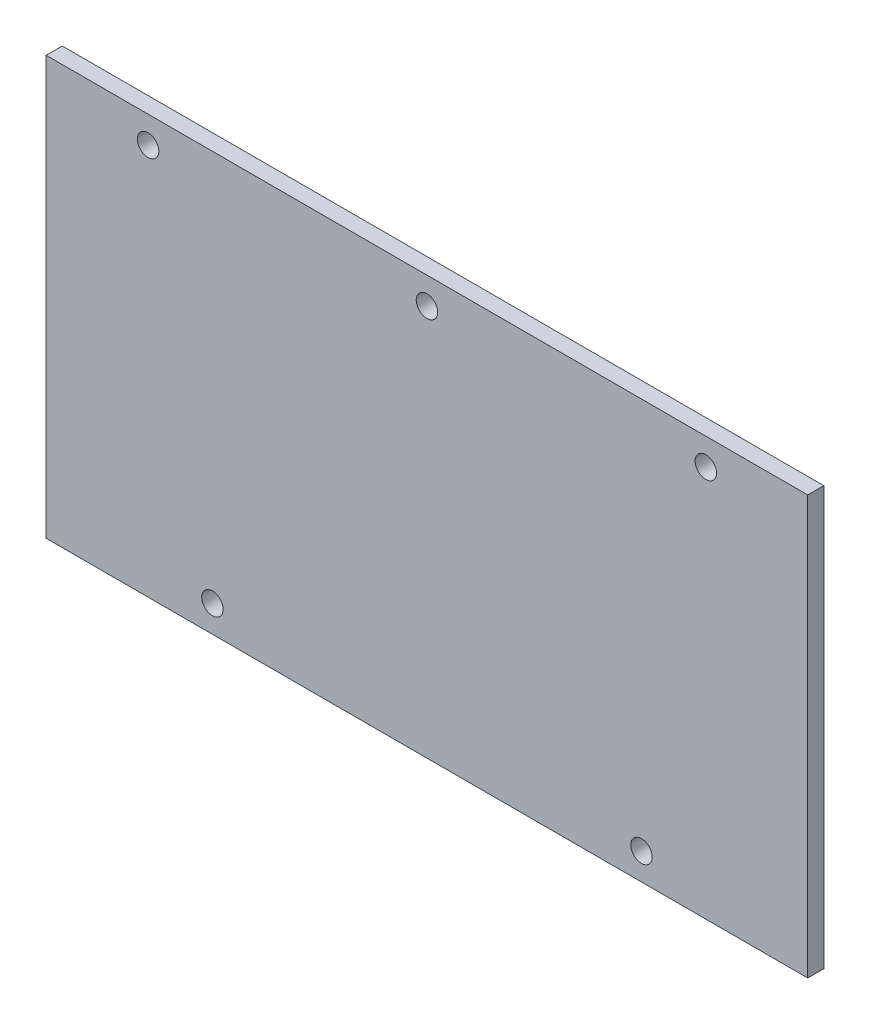
ISO-10303-21;
HEADER;
FILE_DESCRIPTION(('STEP AP214'),'2;1');
FILE_NAME('part.step','',(''),(''),'','','');
FILE_SCHEMA(('AUTOMOTIVE_DESIGN { 1 0 10303 214 1 1 1 1 }'));
ENDSEC;
DATA;
#1=APPLICATION_CONTEXT('core data for automotive mechanical design processes');
#2=APPLICATION_PROTOCOL_DEFINITION('international standard','automotive_design',2000,#1);
#3=PRODUCT_CONTEXT('',#1,'mechanical');
#4=PRODUCT('Part','Part','',(#3));
#5=PRODUCT_RELATED_PRODUCT_CATEGORY('part','',(#4));
#6=PRODUCT_DEFINITION_FORMATION('','',#4);
#7=PRODUCT_DEFINITION_CONTEXT('part definition',#1,'design');
#8=PRODUCT_DEFINITION('design','',#6,#7);
#9=PRODUCT_DEFINITION_SHAPE('','',#8);
#10=(LENGTH_UNIT() NAMED_UNIT(*) SI_UNIT(.MILLI.,.METRE.));
#11=(NAMED_UNIT(*) PLANE_ANGLE_UNIT() SI_UNIT($,.RADIAN.));
#12=(NAMED_UNIT(*) SI_UNIT($,.STERADIAN.) SOLID_ANGLE_UNIT());
#13=UNCERTAINTY_MEASURE_WITH_UNIT(LENGTH_MEASURE(1.E-05),#10,'distance_accuracy_value','');
#14=(GEOMETRIC_REPRESENTATION_CONTEXT(3) GLOBAL_UNCERTAINTY_ASSIGNED_CONTEXT((#13)) GLOBAL_UNIT_ASSIGNED_CONTEXT((#10,
#11,#12)) REPRESENTATION_CONTEXT('',''));
#15=CARTESIAN_POINT('',(0.,0.,0.));
#16=DIRECTION('',(0.,0.,1.));
#17=DIRECTION('',(1.,0.,0.));
#18=AXIS2_PLACEMENT_3D('',#15,#16,#17);
#19=CARTESIAN_POINT('',(-35.5,19.5,1.5));
#20=DIRECTION('',(1.,0.,0.));
#21=DIRECTION('',(0.,0.,-1.));
#22=AXIS2_PLACEMENT_3D('',#19,#20,#21);
#23=PLANE('',#22);
#24=DIRECTION('',(0.,-1.,0.));
#25=VECTOR('',#24,1.);
#26=CARTESIAN_POINT('',(-35.5,19.5,0.));
#27=LINE('',#26,#25);
#28=CARTESIAN_POINT('',(-35.5,19.5,0.));
#29=VERTEX_POINT('',#28);
#30=CARTESIAN_POINT('',(-35.5,-19.5,0.));
#31=VERTEX_POINT('',#30);
#32=EDGE_CURVE('E98',#29,#31,#27,.T.);
#33=ORIENTED_EDGE('',*,*,#32,.T.);
#34=DIRECTION('',(0.,0.,-1.));
#35=VECTOR('',#34,1.);
#36=CARTESIAN_POINT('',(-35.5,-19.5,1.5));
#37=LINE('',#36,#35);
#38=CARTESIAN_POINT('',(-35.5,-19.5,1.5));
#39=VERTEX_POINT('',#38);
#40=EDGE_CURVE('E11',#39,#31,#37,.T.);
#41=ORIENTED_EDGE('',*,*,#40,.F.);
#42=DIRECTION('',(0.,-1.,0.));
#43=VECTOR('',#42,1.);
#44=CARTESIAN_POINT('',(-35.5,19.5,1.5));
#45=LINE('',#44,#43);
#46=CARTESIAN_POINT('',(-35.5,19.5,1.5));
#47=VERTEX_POINT('',#46);
#48=EDGE_CURVE('E86',#47,#39,#45,.T.);
#49=ORIENTED_EDGE('',*,*,#48,.F.);
#50=DIRECTION('',(0.,0.,-1.));
#51=VECTOR('',#50,1.);
#52=CARTESIAN_POINT('',(-35.5,19.5,1.5));
#53=LINE('',#52,#51);
#54=EDGE_CURVE('E94',#47,#29,#53,.T.);
#55=ORIENTED_EDGE('',*,*,#54,.T.);
#56=EDGE_LOOP('',(#33,#41,#49,#55));
#57=FACE_BOUND('',#56,.T.);
#58=ADVANCED_FACE('F35',(#57),#23,.F.);
#59=CARTESIAN_POINT('',(35.5,-19.5,1.5));
#60=DIRECTION('',(0.,1.,0.));
#61=DIRECTION('',(-1.,0.,0.));
#62=AXIS2_PLACEMENT_3D('',#59,#60,#61);
#63=PLANE('',#62);
#64=DIRECTION('',(1.,0.,0.));
#65=VECTOR('',#64,1.);
#66=CARTESIAN_POINT('',(35.5,-19.5,0.));
#67=LINE('',#66,#65);
#68=CARTESIAN_POINT('',(35.5,-19.5,0.));
#69=VERTEX_POINT('',#68);
#70=EDGE_CURVE('E90',#31,#69,#67,.T.);
#71=ORIENTED_EDGE('',*,*,#70,.T.);
#72=DIRECTION('',(0.,0.,-1.));
#73=VECTOR('',#72,1.);
#74=CARTESIAN_POINT('',(35.5,-19.5,1.5));
#75=LINE('',#74,#73);
#76=CARTESIAN_POINT('',(35.5,-19.5,1.5));
#77=VERTEX_POINT('',#76);
#78=EDGE_CURVE('E43',#77,#69,#75,.T.);
#79=ORIENTED_EDGE('',*,*,#78,.F.);
#80=DIRECTION('',(1.,0.,0.));
#81=VECTOR('',#80,1.);
#82=CARTESIAN_POINT('',(35.5,-19.5,1.5));
#83=LINE('',#82,#81);
#84=EDGE_CURVE('E81',#39,#77,#83,.T.);
#85=ORIENTED_EDGE('',*,*,#84,.F.);
#86=ORIENTED_EDGE('',*,*,#40,.T.);
#87=EDGE_LOOP('',(#71,#79,#85,#86));
#88=FACE_BOUND('',#87,.T.);
#89=ADVANCED_FACE('F89',(#88),#63,.F.);
#90=CARTESIAN_POINT('',(35.5,19.5,1.5));
#91=DIRECTION('',(-1.,0.,0.));
#92=DIRECTION('',(0.,-1.,0.));
#93=AXIS2_PLACEMENT_3D('',#90,#91,#92);
#94=PLANE('',#93);
#95=DIRECTION('',(0.,1.,0.));
#96=VECTOR('',#95,1.);
#97=CARTESIAN_POINT('',(35.5,19.5,0.));
#98=LINE('',#97,#96);
#99=CARTESIAN_POINT('',(35.5,19.5,0.));
#100=VERTEX_POINT('',#99);
#101=EDGE_CURVE('E68',#69,#100,#98,.T.);
#102=ORIENTED_EDGE('',*,*,#101,.T.);
#103=DIRECTION('',(0.,0.,-1.));
#104=VECTOR('',#103,1.);
#105=CARTESIAN_POINT('',(35.5,19.5,1.5));
#106=LINE('',#105,#104);
#107=CARTESIAN_POINT('',(35.5,19.5,1.5));
#108=VERTEX_POINT('',#107);
#109=EDGE_CURVE('E91',#108,#100,#106,.T.);
#110=ORIENTED_EDGE('',*,*,#109,.F.);
#111=DIRECTION('',(0.,1.,0.));
#112=VECTOR('',#111,1.);
#113=CARTESIAN_POINT('',(35.5,19.5,1.5));
#114=LINE('',#113,#112);
#115=EDGE_CURVE('E84',#77,#108,#114,.T.);
#116=ORIENTED_EDGE('',*,*,#115,.F.);
#117=ORIENTED_EDGE('',*,*,#78,.T.);
#118=EDGE_LOOP('',(#102,#110,#116,#117));
#119=FACE_BOUND('',#118,.T.);
#120=ADVANCED_FACE('F92',(#119),#94,.F.);
#121=CARTESIAN_POINT('',(35.5,19.5,1.5));
#122=DIRECTION('',(0.,-1.,0.));
#123=DIRECTION('',(1.,0.,0.));
#124=AXIS2_PLACEMENT_3D('',#121,#122,#123);
#125=PLANE('',#124);
#126=DIRECTION('',(-1.,0.,0.));
#127=VECTOR('',#126,1.);
#128=CARTESIAN_POINT('',(35.5,19.5,0.));
#129=LINE('',#128,#127);
#130=EDGE_CURVE('E74',#100,#29,#129,.T.);
#131=ORIENTED_EDGE('',*,*,#130,.T.);
#132=ORIENTED_EDGE('',*,*,#54,.F.);
#133=DIRECTION('',(-1.,0.,0.));
#134=VECTOR('',#133,1.);
#135=CARTESIAN_POINT('',(35.5,19.5,1.5));
#136=LINE('',#135,#134);
#137=EDGE_CURVE('E51',#108,#47,#136,.T.);
#138=ORIENTED_EDGE('',*,*,#137,.F.);
#139=ORIENTED_EDGE('',*,*,#109,.T.);
#140=EDGE_LOOP('',(#131,#132,#138,#139));
#141=FACE_BOUND('',#140,.T.);
#142=ADVANCED_FACE('F106',(#141),#125,.F.);
#143=CARTESIAN_POINT('',(0.,0.,1.5));
#144=DIRECTION('',(0.,0.,-1.));
#145=DIRECTION('',(-1.,0.,0.));
#146=AXIS2_PLACEMENT_3D('',#143,#144,#145);
#147=PLANE('',#146);
#148=CARTESIAN_POINT('',(26.,17.,1.5));
#149=DIRECTION('',(0.,0.,1.));
#150=DIRECTION('',(1.,0.,0.));
#151=AXIS2_PLACEMENT_3D('',#148,#149,#150);
#152=CIRCLE('',#151,1.);
#153=CARTESIAN_POINT('',(27.,17.,1.5));
#154=VERTEX_POINT('',#153);
#155=EDGE_CURVE('E136',#154,#154,#152,.T.);
#156=ORIENTED_EDGE('',*,*,#155,.F.);
#157=EDGE_LOOP('',(#156));
#158=FACE_BOUND('',#157,.T.);
#159=CARTESIAN_POINT('',(-26.,17.,1.5));
#160=DIRECTION('',(0.,0.,1.));
#161=DIRECTION('',(1.,0.,0.));
#162=AXIS2_PLACEMENT_3D('',#159,#160,#161);
#163=CIRCLE('',#162,1.);
#164=CARTESIAN_POINT('',(-25.,17.,1.5));
#165=VERTEX_POINT('',#164);
#166=EDGE_CURVE('E130',#165,#165,#163,.T.);
#167=ORIENTED_EDGE('',*,*,#166,.F.);
#168=EDGE_LOOP('',(#167));
#169=FACE_BOUND('',#168,.T.);
#170=CARTESIAN_POINT('',(0.,17.,1.5));
#171=DIRECTION('',(0.,0.,1.));
#172=DIRECTION('',(1.,0.,0.));
#173=AXIS2_PLACEMENT_3D('',#170,#171,#172);
#174=CIRCLE('',#173,1.);
#175=CARTESIAN_POINT('',(1.00000000000001,17.,1.5));
#176=VERTEX_POINT('',#175);
#177=EDGE_CURVE('E124',#176,#176,#174,.T.);
#178=ORIENTED_EDGE('',*,*,#177,.F.);
#179=EDGE_LOOP('',(#178));
#180=FACE_BOUND('',#179,.T.);
#181=CARTESIAN_POINT('',(20.,-17.,1.5));
#182=DIRECTION('',(0.,0.,1.));
#183=DIRECTION('',(1.,0.,0.));
#184=AXIS2_PLACEMENT_3D('',#181,#182,#183);
#185=CIRCLE('',#184,1.);
#186=CARTESIAN_POINT('',(21.,-17.,1.5));
#187=VERTEX_POINT('',#186);
#188=EDGE_CURVE('E118',#187,#187,#185,.T.);
#189=ORIENTED_EDGE('',*,*,#188,.F.);
#190=EDGE_LOOP('',(#189));
#191=FACE_BOUND('',#190,.T.);
#192=CARTESIAN_POINT('',(-20.,-17.,1.5));
#193=DIRECTION('',(0.,0.,1.));
#194=DIRECTION('',(1.,0.,0.));
#195=AXIS2_PLACEMENT_3D('',#192,#193,#194);
#196=CIRCLE('',#195,1.);
#197=CARTESIAN_POINT('',(-19.,-17.,1.5));
#198=VERTEX_POINT('',#197);
#199=EDGE_CURVE('E112',#198,#198,#196,.T.);
#200=ORIENTED_EDGE('',*,*,#199,.F.);
#201=EDGE_LOOP('',(#200));
#202=FACE_BOUND('',#201,.T.);
#203=ORIENTED_EDGE('',*,*,#48,.T.);
#204=ORIENTED_EDGE('',*,*,#84,.T.);
#205=ORIENTED_EDGE('',*,*,#115,.T.);
#206=ORIENTED_EDGE('',*,*,#137,.T.);
#207=EDGE_LOOP('',(#203,#204,#205,#206));
#208=FACE_BOUND('',#207,.T.);
#209=ADVANCED_FACE('F82',(#158,#169,#180,#191,#202,#208),#147,.F.);
#210=CARTESIAN_POINT('',(0.,0.,0.));
#211=DIRECTION('',(0.,0.,-1.));
#212=DIRECTION('',(-1.,0.,0.));
#213=AXIS2_PLACEMENT_3D('',#210,#211,#212);
#214=PLANE('',#213);
#215=CARTESIAN_POINT('',(26.,17.,0.));
#216=DIRECTION('',(0.,0.,1.));
#217=DIRECTION('',(1.,0.,0.));
#218=AXIS2_PLACEMENT_3D('',#215,#216,#217);
#219=CIRCLE('',#218,1.);
#220=CARTESIAN_POINT('',(27.,17.,0.));
#221=VERTEX_POINT('',#220);
#222=EDGE_CURVE('E101',#221,#221,#219,.T.);
#223=ORIENTED_EDGE('',*,*,#222,.T.);
#224=EDGE_LOOP('',(#223));
#225=FACE_BOUND('',#224,.T.);
#226=CARTESIAN_POINT('',(-26.,17.,0.));
#227=DIRECTION('',(0.,0.,1.));
#228=DIRECTION('',(1.,0.,0.));
#229=AXIS2_PLACEMENT_3D('',#226,#227,#228);
#230=CIRCLE('',#229,1.);
#231=CARTESIAN_POINT('',(-25.,17.,0.));
#232=VERTEX_POINT('',#231);
#233=EDGE_CURVE('E133',#232,#232,#230,.T.);
#234=ORIENTED_EDGE('',*,*,#233,.T.);
#235=EDGE_LOOP('',(#234));
#236=FACE_BOUND('',#235,.T.);
#237=CARTESIAN_POINT('',(0.,17.,0.));
#238=DIRECTION('',(0.,0.,1.));
#239=DIRECTION('',(1.,0.,0.));
#240=AXIS2_PLACEMENT_3D('',#237,#238,#239);
#241=CIRCLE('',#240,1.);
#242=CARTESIAN_POINT('',(1.00000000000001,17.,0.));
#243=VERTEX_POINT('',#242);
#244=EDGE_CURVE('E127',#243,#243,#241,.T.);
#245=ORIENTED_EDGE('',*,*,#244,.T.);
#246=EDGE_LOOP('',(#245));
#247=FACE_BOUND('',#246,.T.);
#248=CARTESIAN_POINT('',(20.,-17.,0.));
#249=DIRECTION('',(0.,0.,1.));
#250=DIRECTION('',(1.,0.,0.));
#251=AXIS2_PLACEMENT_3D('',#248,#249,#250);
#252=CIRCLE('',#251,1.);
#253=CARTESIAN_POINT('',(21.,-17.,0.));
#254=VERTEX_POINT('',#253);
#255=EDGE_CURVE('E121',#254,#254,#252,.T.);
#256=ORIENTED_EDGE('',*,*,#255,.T.);
#257=EDGE_LOOP('',(#256));
#258=FACE_BOUND('',#257,.T.);
#259=CARTESIAN_POINT('',(-20.,-17.,0.));
#260=DIRECTION('',(0.,0.,1.));
#261=DIRECTION('',(1.,0.,0.));
#262=AXIS2_PLACEMENT_3D('',#259,#260,#261);
#263=CIRCLE('',#262,1.);
#264=CARTESIAN_POINT('',(-19.,-17.,0.));
#265=VERTEX_POINT('',#264);
#266=EDGE_CURVE('E115',#265,#265,#263,.T.);
#267=ORIENTED_EDGE('',*,*,#266,.T.);
#268=EDGE_LOOP('',(#267));
#269=FACE_BOUND('',#268,.T.);
#270=ORIENTED_EDGE('',*,*,#32,.F.);
#271=ORIENTED_EDGE('',*,*,#130,.F.);
#272=ORIENTED_EDGE('',*,*,#101,.F.);
#273=ORIENTED_EDGE('',*,*,#70,.F.);
#274=EDGE_LOOP('',(#270,#271,#272,#273));
#275=FACE_BOUND('',#274,.T.);
#276=ADVANCED_FACE('F109',(#225,#236,#247,#258,#269,#275),#214,.T.);
#277=CARTESIAN_POINT('',(-20.,-17.,0.));
#278=DIRECTION('',(0.,0.,1.));
#279=DIRECTION('',(1.,0.,0.));
#280=AXIS2_PLACEMENT_3D('',#277,#278,#279);
#281=CYLINDRICAL_SURFACE('',#280,1.);
#282=ORIENTED_EDGE('',*,*,#266,.F.);
#283=EDGE_LOOP('',(#282));
#284=FACE_BOUND('',#283,.T.);
#285=ORIENTED_EDGE('',*,*,#199,.T.);
#286=EDGE_LOOP('',(#285));
#287=FACE_BOUND('',#286,.T.);
#288=ADVANCED_FACE('F162',(#284,#287),#281,.F.);
#289=CARTESIAN_POINT('',(20.,-17.,0.));
#290=DIRECTION('',(0.,0.,1.));
#291=DIRECTION('',(1.,0.,0.));
#292=AXIS2_PLACEMENT_3D('',#289,#290,#291);
#293=CYLINDRICAL_SURFACE('',#292,1.);
#294=ORIENTED_EDGE('',*,*,#255,.F.);
#295=EDGE_LOOP('',(#294));
#296=FACE_BOUND('',#295,.T.);
#297=ORIENTED_EDGE('',*,*,#188,.T.);
#298=EDGE_LOOP('',(#297));
#299=FACE_BOUND('',#298,.T.);
#300=ADVANCED_FACE('F164',(#296,#299),#293,.F.);
#301=CARTESIAN_POINT('',(0.,17.,0.));
#302=DIRECTION('',(0.,0.,1.));
#303=DIRECTION('',(1.,0.,0.));
#304=AXIS2_PLACEMENT_3D('',#301,#302,#303);
#305=CYLINDRICAL_SURFACE('',#304,1.);
#306=ORIENTED_EDGE('',*,*,#244,.F.);
#307=EDGE_LOOP('',(#306));
#308=FACE_BOUND('',#307,.T.);
#309=ORIENTED_EDGE('',*,*,#177,.T.);
#310=EDGE_LOOP('',(#309));
#311=FACE_BOUND('',#310,.T.);
#312=ADVANCED_FACE('F171',(#308,#311),#305,.F.);
#313=CARTESIAN_POINT('',(-26.,17.,0.));
#314=DIRECTION('',(0.,0.,1.));
#315=DIRECTION('',(1.,0.,0.));
#316=AXIS2_PLACEMENT_3D('',#313,#314,#315);
#317=CYLINDRICAL_SURFACE('',#316,1.);
#318=ORIENTED_EDGE('',*,*,#233,.F.);
#319=EDGE_LOOP('',(#318));
#320=FACE_BOUND('',#319,.T.);
#321=ORIENTED_EDGE('',*,*,#166,.T.);
#322=EDGE_LOOP('',(#321));
#323=FACE_BOUND('',#322,.T.);
#324=ADVANCED_FACE('F147',(#320,#323),#317,.F.);
#325=CARTESIAN_POINT('',(26.,17.,0.));
#326=DIRECTION('',(0.,0.,1.));
#327=DIRECTION('',(1.,0.,0.));
#328=AXIS2_PLACEMENT_3D('',#325,#326,#327);
#329=CYLINDRICAL_SURFACE('',#328,1.);
#330=ORIENTED_EDGE('',*,*,#222,.F.);
#331=EDGE_LOOP('',(#330));
#332=FACE_BOUND('',#331,.T.);
#333=ORIENTED_EDGE('',*,*,#155,.T.);
#334=EDGE_LOOP('',(#333));
#335=FACE_BOUND('',#334,.T.);
#336=ADVANCED_FACE('F144',(#332,#335),#329,.F.);
#337=CLOSED_SHELL('',(#58,#89,#120,#142,#209,#276,#288,#300,#312,#324,#336));
#338=MANIFOLD_SOLID_BREP('B2',#337);
#339=ADVANCED_BREP_SHAPE_REPRESENTATION('',(#18,#338),#14);
#340=SHAPE_DEFINITION_REPRESENTATION(#9,#339);
ENDSEC;
END-ISO-10303-21;
